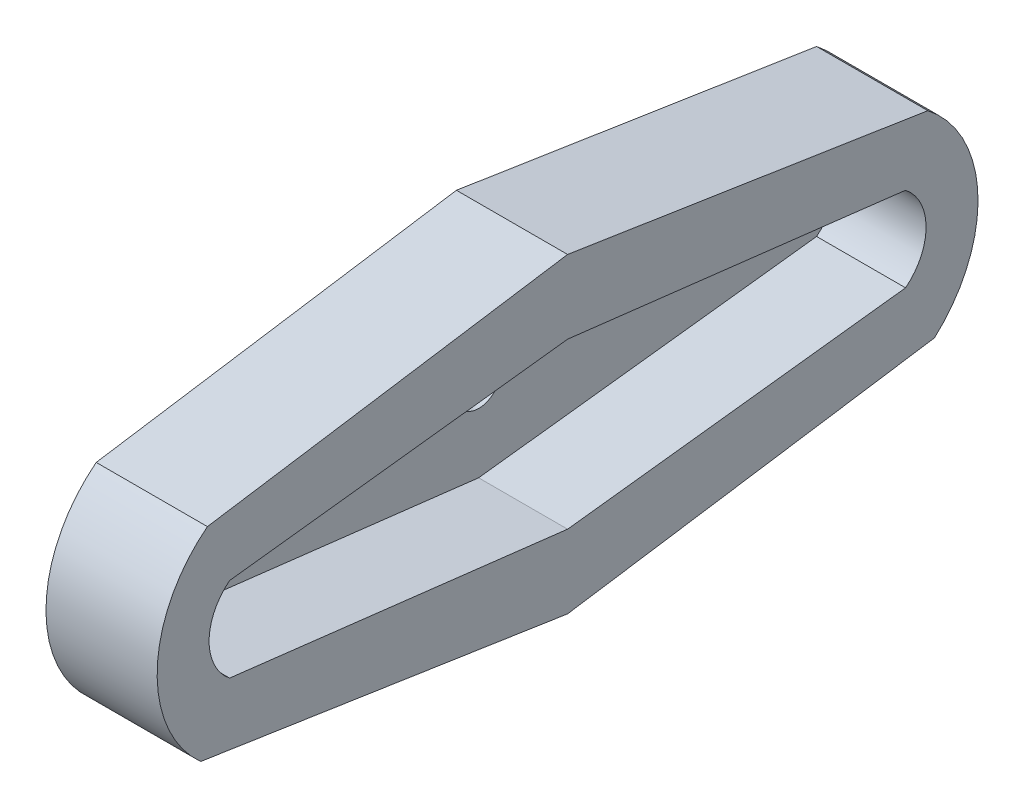
ISO-10303-21;
HEADER;
FILE_DESCRIPTION(('STEP AP214'),'2;1');
FILE_NAME('part.step','',(''),(''),'','','');
FILE_SCHEMA(('AUTOMOTIVE_DESIGN { 1 0 10303 214 1 1 1 1 }'));
ENDSEC;
DATA;
#1=APPLICATION_CONTEXT('core data for automotive mechanical design processes');
#2=APPLICATION_PROTOCOL_DEFINITION('international standard','automotive_design',2000,#1);
#3=PRODUCT_CONTEXT('',#1,'mechanical');
#4=PRODUCT('Part','Part','',(#3));
#5=PRODUCT_RELATED_PRODUCT_CATEGORY('part','',(#4));
#6=PRODUCT_DEFINITION_FORMATION('','',#4);
#7=PRODUCT_DEFINITION_CONTEXT('part definition',#1,'design');
#8=PRODUCT_DEFINITION('design','',#6,#7);
#9=PRODUCT_DEFINITION_SHAPE('','',#8);
#10=(LENGTH_UNIT() NAMED_UNIT(*) SI_UNIT(.MILLI.,.METRE.));
#11=(NAMED_UNIT(*) PLANE_ANGLE_UNIT() SI_UNIT($,.RADIAN.));
#12=(NAMED_UNIT(*) SI_UNIT($,.STERADIAN.) SOLID_ANGLE_UNIT());
#13=UNCERTAINTY_MEASURE_WITH_UNIT(LENGTH_MEASURE(1.E-05),#10,'distance_accuracy_value','');
#14=(GEOMETRIC_REPRESENTATION_CONTEXT(3) GLOBAL_UNCERTAINTY_ASSIGNED_CONTEXT((#13)) GLOBAL_UNIT_ASSIGNED_CONTEXT((#10,
#11,#12)) REPRESENTATION_CONTEXT('',''));
#15=CARTESIAN_POINT('',(0.,0.,0.));
#16=DIRECTION('',(0.,0.,1.));
#17=DIRECTION('',(1.,0.,0.));
#18=AXIS2_PLACEMENT_3D('',#15,#16,#17);
#19=CARTESIAN_POINT('',(4.,-0.125126562134235,-12.5962031359729));
#20=DIRECTION('',(-1.,0.,0.));
#21=DIRECTION('',(0.,0.,1.));
#22=AXIS2_PLACEMENT_3D('',#19,#20,#21);
#23=PLANE('',#22);
#24=DIRECTION('',(0.,0.152515596279737,0.988301063892697));
#25=VECTOR('',#24,1.);
#26=CARTESIAN_POINT('',(4.,7.,0.));
#27=LINE('',#26,#25);
#28=CARTESIAN_POINT('',(4.,4.5,-16.2));
#29=VERTEX_POINT('',#28);
#30=CARTESIAN_POINT('',(4.,7.,0.));
#31=VERTEX_POINT('',#30);
#32=EDGE_CURVE('E232',#29,#31,#27,.T.);
#33=ORIENTED_EDGE('',*,*,#32,.T.);
#34=DIRECTION('',(0.,-0.152515596279737,0.988301063892697));
#35=VECTOR('',#34,1.);
#36=CARTESIAN_POINT('',(4.,7.,0.));
#37=LINE('',#36,#35);
#38=CARTESIAN_POINT('',(4.,4.5,16.2));
#39=VERTEX_POINT('',#38);
#40=EDGE_CURVE('E134',#31,#39,#37,.T.);
#41=ORIENTED_EDGE('',*,*,#40,.T.);
#42=CARTESIAN_POINT('',(4.,-0.125126562134238,12.5962031359729));
#43=DIRECTION('',(1.,0.,0.));
#44=DIRECTION('',(0.,0.,-1.));
#45=AXIS2_PLACEMENT_3D('',#42,#43,#44);
#46=CIRCLE('',#45,5.8633733936132);
#47=CARTESIAN_POINT('',(4.,-4.5,16.5));
#48=VERTEX_POINT('',#47);
#49=EDGE_CURVE('E237',#39,#48,#46,.T.);
#50=ORIENTED_EDGE('',*,*,#49,.T.);
#51=DIRECTION('',(0.,-0.149805379427995,-0.988715504224767));
#52=VECTOR('',#51,1.);
#53=CARTESIAN_POINT('',(4.,-4.5,16.5));
#54=LINE('',#53,#52);
#55=CARTESIAN_POINT('',(4.,-7.,0.));
#56=VERTEX_POINT('',#55);
#57=EDGE_CURVE('E240',#48,#56,#54,.T.);
#58=ORIENTED_EDGE('',*,*,#57,.T.);
#59=DIRECTION('',(0.,0.149805379427995,-0.988715504224767));
#60=VECTOR('',#59,1.);
#61=CARTESIAN_POINT('',(4.,-4.5,-16.5));
#62=LINE('',#61,#60);
#63=CARTESIAN_POINT('',(4.,-4.5,-16.5));
#64=VERTEX_POINT('',#63);
#65=EDGE_CURVE('E243',#56,#64,#62,.T.);
#66=ORIENTED_EDGE('',*,*,#65,.T.);
#67=CARTESIAN_POINT('',(4.,-0.125126562134235,-12.5962031359729));
#68=DIRECTION('',(1.,0.,0.));
#69=DIRECTION('',(0.,0.,1.));
#70=AXIS2_PLACEMENT_3D('',#67,#68,#69);
#71=CIRCLE('',#70,5.8633733936132);
#72=EDGE_CURVE('E246',#64,#29,#71,.T.);
#73=ORIENTED_EDGE('',*,*,#72,.T.);
#74=EDGE_LOOP('',(#33,#41,#50,#58,#66,#73));
#75=FACE_BOUND('',#74,.T.);
#76=DIRECTION('',(0.,0.117599343536163,0.993061123194269));
#77=VECTOR('',#76,1.);
#78=CARTESIAN_POINT('',(4.,3.7,0.));
#79=LINE('',#78,#77);
#80=CARTESIAN_POINT('',(4.,1.9,-15.2));
#81=VERTEX_POINT('',#80);
#82=CARTESIAN_POINT('',(4.,3.7,0.));
#83=VERTEX_POINT('',#82);
#84=EDGE_CURVE('E175',#81,#83,#79,.T.);
#85=ORIENTED_EDGE('',*,*,#84,.F.);
#86=CARTESIAN_POINT('',(4.,0.,-13.7066815476932));
#87=DIRECTION('',(1.,0.,0.));
#88=DIRECTION('',(0.,0.,1.));
#89=AXIS2_PLACEMENT_3D('',#86,#87,#88);
#90=CIRCLE('',#89,2.41660919471891);
#91=CARTESIAN_POINT('',(4.,-1.9,-15.2));
#92=VERTEX_POINT('',#91);
#93=EDGE_CURVE('E191',#92,#81,#90,.T.);
#94=ORIENTED_EDGE('',*,*,#93,.F.);
#95=DIRECTION('',(0.,0.117599343536164,-0.993061123194269));
#96=VECTOR('',#95,1.);
#97=CARTESIAN_POINT('',(4.,-1.9,-15.2));
#98=LINE('',#97,#96);
#99=CARTESIAN_POINT('',(4.,-3.7,0.));
#100=VERTEX_POINT('',#99);
#101=EDGE_CURVE('E188',#100,#92,#98,.T.);
#102=ORIENTED_EDGE('',*,*,#101,.F.);
#103=DIRECTION('',(0.,-0.117599343536163,-0.993061123194269));
#104=VECTOR('',#103,1.);
#105=CARTESIAN_POINT('',(4.,-1.9,15.2));
#106=LINE('',#105,#104);
#107=CARTESIAN_POINT('',(4.,-1.9,15.2));
#108=VERTEX_POINT('',#107);
#109=EDGE_CURVE('E185',#108,#100,#106,.T.);
#110=ORIENTED_EDGE('',*,*,#109,.F.);
#111=CARTESIAN_POINT('',(4.,0.,13.7066815476932));
#112=DIRECTION('',(1.,0.,0.));
#113=DIRECTION('',(0.,0.,-1.));
#114=AXIS2_PLACEMENT_3D('',#111,#112,#113);
#115=CIRCLE('',#114,2.41660919471891);
#116=CARTESIAN_POINT('',(4.,1.9,15.2));
#117=VERTEX_POINT('',#116);
#118=EDGE_CURVE('E182',#117,#108,#115,.T.);
#119=ORIENTED_EDGE('',*,*,#118,.F.);
#120=DIRECTION('',(0.,-0.117599343536163,0.993061123194269));
#121=VECTOR('',#120,1.);
#122=CARTESIAN_POINT('',(4.,3.7,0.));
#123=LINE('',#122,#121);
#124=EDGE_CURVE('E178',#83,#117,#123,.T.);
#125=ORIENTED_EDGE('',*,*,#124,.F.);
#126=EDGE_LOOP('',(#85,#94,#102,#110,#119,#125));
#127=FACE_BOUND('',#126,.T.);
#128=ADVANCED_FACE('F39',(#75,#127),#23,.F.);
#129=CARTESIAN_POINT('',(4.,7.,0.));
#130=DIRECTION('',(0.,-0.988301063892697,0.152515596279737));
#131=DIRECTION('',(0.,-0.152515596279737,-0.988301063892697));
#132=AXIS2_PLACEMENT_3D('',#129,#130,#131);
#133=PLANE('',#132);
#134=DIRECTION('',(-1.,0.,0.));
#135=VECTOR('',#134,1.);
#136=CARTESIAN_POINT('',(4.,4.5,-16.2));
#137=LINE('',#136,#135);
#138=CARTESIAN_POINT('',(-1.,4.5,-16.2));
#139=VERTEX_POINT('',#138);
#140=EDGE_CURVE('E152',#29,#139,#137,.T.);
#141=ORIENTED_EDGE('',*,*,#140,.T.);
#142=DIRECTION('',(0.,0.152515596279737,0.988301063892697));
#143=VECTOR('',#142,1.);
#144=CARTESIAN_POINT('',(-1.,7.,0.));
#145=LINE('',#144,#143);
#146=CARTESIAN_POINT('',(-1.,7.,0.));
#147=VERTEX_POINT('',#146);
#148=EDGE_CURVE('E144',#139,#147,#145,.T.);
#149=ORIENTED_EDGE('',*,*,#148,.T.);
#150=DIRECTION('',(-1.,0.,0.));
#151=VECTOR('',#150,1.);
#152=CARTESIAN_POINT('',(4.,7.,0.));
#153=LINE('',#152,#151);
#154=EDGE_CURVE('E11',#31,#147,#153,.T.);
#155=ORIENTED_EDGE('',*,*,#154,.F.);
#156=ORIENTED_EDGE('',*,*,#32,.F.);
#157=EDGE_LOOP('',(#141,#149,#155,#156));
#158=FACE_BOUND('',#157,.T.);
#159=ADVANCED_FACE('F41',(#158),#133,.F.);
#160=CARTESIAN_POINT('',(4.,7.,0.));
#161=DIRECTION('',(0.,-0.988301063892697,-0.152515596279737));
#162=DIRECTION('',(0.,0.152515596279737,-0.988301063892697));
#163=AXIS2_PLACEMENT_3D('',#160,#161,#162);
#164=PLANE('',#163);
#165=ORIENTED_EDGE('',*,*,#154,.T.);
#166=DIRECTION('',(0.,-0.152515596279737,0.988301063892697));
#167=VECTOR('',#166,1.);
#168=CARTESIAN_POINT('',(-1.,7.,0.));
#169=LINE('',#168,#167);
#170=CARTESIAN_POINT('',(-1.,4.5,16.2));
#171=VERTEX_POINT('',#170);
#172=EDGE_CURVE('E133',#147,#171,#169,.T.);
#173=ORIENTED_EDGE('',*,*,#172,.T.);
#174=DIRECTION('',(-1.,0.,0.));
#175=VECTOR('',#174,1.);
#176=CARTESIAN_POINT('',(4.,4.5,16.2));
#177=LINE('',#176,#175);
#178=EDGE_CURVE('E48',#39,#171,#177,.T.);
#179=ORIENTED_EDGE('',*,*,#178,.F.);
#180=ORIENTED_EDGE('',*,*,#40,.F.);
#181=EDGE_LOOP('',(#165,#173,#179,#180));
#182=FACE_BOUND('',#181,.T.);
#183=ADVANCED_FACE('F131',(#182),#164,.F.);
#184=CARTESIAN_POINT('',(4.,-0.125126562134238,12.5962031359729));
#185=DIRECTION('',(-1.,0.,0.));
#186=DIRECTION('',(0.,0.,1.));
#187=AXIS2_PLACEMENT_3D('',#184,#185,#186);
#188=CYLINDRICAL_SURFACE('',#187,5.8633733936132);
#189=ORIENTED_EDGE('',*,*,#178,.T.);
#190=CARTESIAN_POINT('',(-1.,-0.125126562134238,12.5962031359729));
#191=DIRECTION('',(1.,0.,0.));
#192=DIRECTION('',(0.,0.,-1.));
#193=AXIS2_PLACEMENT_3D('',#190,#191,#192);
#194=CIRCLE('',#193,5.8633733936132);
#195=CARTESIAN_POINT('',(-1.,-4.5,16.5));
#196=VERTEX_POINT('',#195);
#197=EDGE_CURVE('E148',#171,#196,#194,.T.);
#198=ORIENTED_EDGE('',*,*,#197,.T.);
#199=DIRECTION('',(-1.,0.,0.));
#200=VECTOR('',#199,1.);
#201=CARTESIAN_POINT('',(4.,-4.5,16.5));
#202=LINE('',#201,#200);
#203=EDGE_CURVE('E257',#48,#196,#202,.T.);
#204=ORIENTED_EDGE('',*,*,#203,.F.);
#205=ORIENTED_EDGE('',*,*,#49,.F.);
#206=EDGE_LOOP('',(#189,#198,#204,#205));
#207=FACE_BOUND('',#206,.T.);
#208=ADVANCED_FACE('F262',(#207),#188,.T.);
#209=CARTESIAN_POINT('',(4.,-4.5,16.5));
#210=DIRECTION('',(0.,0.988715504224767,-0.149805379427995));
#211=DIRECTION('',(0.,0.149805379427995,0.988715504224767));
#212=AXIS2_PLACEMENT_3D('',#209,#210,#211);
#213=PLANE('',#212);
#214=ORIENTED_EDGE('',*,*,#203,.T.);
#215=DIRECTION('',(0.,-0.149805379427995,-0.988715504224767));
#216=VECTOR('',#215,1.);
#217=CARTESIAN_POINT('',(-1.,-4.5,16.5));
#218=LINE('',#217,#216);
#219=CARTESIAN_POINT('',(-1.,-7.,0.));
#220=VERTEX_POINT('',#219);
#221=EDGE_CURVE('E164',#196,#220,#218,.T.);
#222=ORIENTED_EDGE('',*,*,#221,.T.);
#223=DIRECTION('',(-1.,0.,0.));
#224=VECTOR('',#223,1.);
#225=CARTESIAN_POINT('',(4.,-7.,0.));
#226=LINE('',#225,#224);
#227=EDGE_CURVE('E254',#56,#220,#226,.T.);
#228=ORIENTED_EDGE('',*,*,#227,.F.);
#229=ORIENTED_EDGE('',*,*,#57,.F.);
#230=EDGE_LOOP('',(#214,#222,#228,#229));
#231=FACE_BOUND('',#230,.T.);
#232=ADVANCED_FACE('F276',(#231),#213,.F.);
#233=CARTESIAN_POINT('',(4.,-4.5,-16.5));
#234=DIRECTION('',(0.,0.988715504224767,0.149805379427995));
#235=DIRECTION('',(0.,-0.149805379427995,0.988715504224767));
#236=AXIS2_PLACEMENT_3D('',#233,#234,#235);
#237=PLANE('',#236);
#238=ORIENTED_EDGE('',*,*,#227,.T.);
#239=DIRECTION('',(0.,0.149805379427995,-0.988715504224767));
#240=VECTOR('',#239,1.);
#241=CARTESIAN_POINT('',(-1.,-4.5,-16.5));
#242=LINE('',#241,#240);
#243=CARTESIAN_POINT('',(-1.,-4.5,-16.5));
#244=VERTEX_POINT('',#243);
#245=EDGE_CURVE('E168',#220,#244,#242,.T.);
#246=ORIENTED_EDGE('',*,*,#245,.T.);
#247=DIRECTION('',(-1.,0.,0.));
#248=VECTOR('',#247,1.);
#249=CARTESIAN_POINT('',(4.,-4.5,-16.5));
#250=LINE('',#249,#248);
#251=EDGE_CURVE('E251',#64,#244,#250,.T.);
#252=ORIENTED_EDGE('',*,*,#251,.F.);
#253=ORIENTED_EDGE('',*,*,#65,.F.);
#254=EDGE_LOOP('',(#238,#246,#252,#253));
#255=FACE_BOUND('',#254,.T.);
#256=ADVANCED_FACE('F277',(#255),#237,.F.);
#257=CARTESIAN_POINT('',(4.,-0.125126562134235,-12.5962031359729));
#258=DIRECTION('',(-1.,0.,0.));
#259=DIRECTION('',(0.,0.,1.));
#260=AXIS2_PLACEMENT_3D('',#257,#258,#259);
#261=CYLINDRICAL_SURFACE('',#260,5.8633733936132);
#262=ORIENTED_EDGE('',*,*,#251,.T.);
#263=CARTESIAN_POINT('',(-1.,-0.125126562134238,-12.5962031359729));
#264=DIRECTION('',(1.,0.,0.));
#265=DIRECTION('',(0.,0.,1.));
#266=AXIS2_PLACEMENT_3D('',#263,#264,#265);
#267=CIRCLE('',#266,5.8633733936132);
#268=EDGE_CURVE('E172',#244,#139,#267,.T.);
#269=ORIENTED_EDGE('',*,*,#268,.T.);
#270=ORIENTED_EDGE('',*,*,#140,.F.);
#271=ORIENTED_EDGE('',*,*,#72,.F.);
#272=EDGE_LOOP('',(#262,#269,#270,#271));
#273=FACE_BOUND('',#272,.T.);
#274=ADVANCED_FACE('F272',(#273),#261,.T.);
#275=CARTESIAN_POINT('',(4.,3.7,0.));
#276=DIRECTION('',(0.,-0.993061123194269,0.117599343536163));
#277=DIRECTION('',(0.,-0.117599343536163,-0.993061123194269));
#278=AXIS2_PLACEMENT_3D('',#275,#276,#277);
#279=PLANE('',#278);
#280=DIRECTION('',(0.,0.117599343536163,0.993061123194269));
#281=VECTOR('',#280,1.);
#282=CARTESIAN_POINT('',(0.,3.7,0.));
#283=LINE('',#282,#281);
#284=CARTESIAN_POINT('',(0.,1.9,-15.2));
#285=VERTEX_POINT('',#284);
#286=CARTESIAN_POINT('',(0.,3.7,0.));
#287=VERTEX_POINT('',#286);
#288=EDGE_CURVE('E63',#285,#287,#283,.T.);
#289=ORIENTED_EDGE('',*,*,#288,.F.);
#290=DIRECTION('',(-1.,0.,0.));
#291=VECTOR('',#290,1.);
#292=CARTESIAN_POINT('',(4.,1.9,-15.2));
#293=LINE('',#292,#291);
#294=EDGE_CURVE('E194',#81,#285,#293,.T.);
#295=ORIENTED_EDGE('',*,*,#294,.F.);
#296=ORIENTED_EDGE('',*,*,#84,.T.);
#297=DIRECTION('',(-1.,0.,0.));
#298=VECTOR('',#297,1.);
#299=CARTESIAN_POINT('',(4.,3.7,0.));
#300=LINE('',#299,#298);
#301=EDGE_CURVE('E229',#83,#287,#300,.T.);
#302=ORIENTED_EDGE('',*,*,#301,.T.);
#303=EDGE_LOOP('',(#289,#295,#296,#302));
#304=FACE_BOUND('',#303,.T.);
#305=ADVANCED_FACE('F284',(#304),#279,.T.);
#306=CARTESIAN_POINT('',(4.,3.7,0.));
#307=DIRECTION('',(0.,-0.993061123194269,-0.117599343536163));
#308=DIRECTION('',(0.,0.117599343536163,-0.993061123194269));
#309=AXIS2_PLACEMENT_3D('',#306,#307,#308);
#310=PLANE('',#309);
#311=DIRECTION('',(0.,-0.117599343536163,0.993061123194269));
#312=VECTOR('',#311,1.);
#313=CARTESIAN_POINT('',(0.,3.7,0.));
#314=LINE('',#313,#312);
#315=CARTESIAN_POINT('',(0.,1.9,15.2));
#316=VERTEX_POINT('',#315);
#317=EDGE_CURVE('E197',#287,#316,#314,.T.);
#318=ORIENTED_EDGE('',*,*,#317,.F.);
#319=ORIENTED_EDGE('',*,*,#301,.F.);
#320=ORIENTED_EDGE('',*,*,#124,.T.);
#321=DIRECTION('',(-1.,0.,0.));
#322=VECTOR('',#321,1.);
#323=CARTESIAN_POINT('',(4.,1.9,15.2));
#324=LINE('',#323,#322);
#325=EDGE_CURVE('E226',#117,#316,#324,.T.);
#326=ORIENTED_EDGE('',*,*,#325,.T.);
#327=EDGE_LOOP('',(#318,#319,#320,#326));
#328=FACE_BOUND('',#327,.T.);
#329=ADVANCED_FACE('F295',(#328),#310,.T.);
#330=CARTESIAN_POINT('',(4.,0.,13.7066815476932));
#331=DIRECTION('',(-1.,0.,0.));
#332=DIRECTION('',(0.,0.,1.));
#333=AXIS2_PLACEMENT_3D('',#330,#331,#332);
#334=CYLINDRICAL_SURFACE('',#333,2.41660919471891);
#335=CARTESIAN_POINT('',(0.,0.,13.7066815476932));
#336=DIRECTION('',(1.,0.,0.));
#337=DIRECTION('',(0.,0.,-1.));
#338=AXIS2_PLACEMENT_3D('',#335,#336,#337);
#339=CIRCLE('',#338,2.41660919471891);
#340=CARTESIAN_POINT('',(0.,-1.9,15.2));
#341=VERTEX_POINT('',#340);
#342=EDGE_CURVE('E201',#316,#341,#339,.T.);
#343=ORIENTED_EDGE('',*,*,#342,.F.);
#344=ORIENTED_EDGE('',*,*,#325,.F.);
#345=ORIENTED_EDGE('',*,*,#118,.T.);
#346=DIRECTION('',(-1.,0.,0.));
#347=VECTOR('',#346,1.);
#348=CARTESIAN_POINT('',(4.,-1.9,15.2));
#349=LINE('',#348,#347);
#350=EDGE_CURVE('E223',#108,#341,#349,.T.);
#351=ORIENTED_EDGE('',*,*,#350,.T.);
#352=EDGE_LOOP('',(#343,#344,#345,#351));
#353=FACE_BOUND('',#352,.T.);
#354=ADVANCED_FACE('F298',(#353),#334,.F.);
#355=CARTESIAN_POINT('',(4.,-1.9,15.2));
#356=DIRECTION('',(0.,0.993061123194269,-0.117599343536163));
#357=DIRECTION('',(0.,0.117599343536163,0.993061123194269));
#358=AXIS2_PLACEMENT_3D('',#355,#356,#357);
#359=PLANE('',#358);
#360=DIRECTION('',(0.,-0.117599343536163,-0.993061123194269));
#361=VECTOR('',#360,1.);
#362=CARTESIAN_POINT('',(0.,-1.9,15.2));
#363=LINE('',#362,#361);
#364=CARTESIAN_POINT('',(0.,-3.7,0.));
#365=VERTEX_POINT('',#364);
#366=EDGE_CURVE('E205',#341,#365,#363,.T.);
#367=ORIENTED_EDGE('',*,*,#366,.F.);
#368=ORIENTED_EDGE('',*,*,#350,.F.);
#369=ORIENTED_EDGE('',*,*,#109,.T.);
#370=DIRECTION('',(-1.,0.,0.));
#371=VECTOR('',#370,1.);
#372=CARTESIAN_POINT('',(4.,-3.7,0.));
#373=LINE('',#372,#371);
#374=EDGE_CURVE('E220',#100,#365,#373,.T.);
#375=ORIENTED_EDGE('',*,*,#374,.T.);
#376=EDGE_LOOP('',(#367,#368,#369,#375));
#377=FACE_BOUND('',#376,.T.);
#378=ADVANCED_FACE('F302',(#377),#359,.T.);
#379=CARTESIAN_POINT('',(4.,-1.9,-15.2));
#380=DIRECTION('',(0.,0.993061123194269,0.117599343536164));
#381=DIRECTION('',(0.,-0.117599343536164,0.993061123194269));
#382=AXIS2_PLACEMENT_3D('',#379,#380,#381);
#383=PLANE('',#382);
#384=DIRECTION('',(0.,0.117599343536164,-0.993061123194269));
#385=VECTOR('',#384,1.);
#386=CARTESIAN_POINT('',(0.,-1.9,-15.2));
#387=LINE('',#386,#385);
#388=CARTESIAN_POINT('',(0.,-1.9,-15.2));
#389=VERTEX_POINT('',#388);
#390=EDGE_CURVE('E209',#365,#389,#387,.T.);
#391=ORIENTED_EDGE('',*,*,#390,.F.);
#392=ORIENTED_EDGE('',*,*,#374,.F.);
#393=ORIENTED_EDGE('',*,*,#101,.T.);
#394=DIRECTION('',(-1.,0.,0.));
#395=VECTOR('',#394,1.);
#396=CARTESIAN_POINT('',(4.,-1.9,-15.2));
#397=LINE('',#396,#395);
#398=EDGE_CURVE('E55',#92,#389,#397,.T.);
#399=ORIENTED_EDGE('',*,*,#398,.T.);
#400=EDGE_LOOP('',(#391,#392,#393,#399));
#401=FACE_BOUND('',#400,.T.);
#402=ADVANCED_FACE('F306',(#401),#383,.T.);
#403=CARTESIAN_POINT('',(4.,0.,-13.7066815476932));
#404=DIRECTION('',(-1.,0.,0.));
#405=DIRECTION('',(0.,0.,1.));
#406=AXIS2_PLACEMENT_3D('',#403,#404,#405);
#407=CYLINDRICAL_SURFACE('',#406,2.41660919471891);
#408=CARTESIAN_POINT('',(0.,0.,-13.7066815476932));
#409=DIRECTION('',(1.,0.,0.));
#410=DIRECTION('',(0.,0.,1.));
#411=AXIS2_PLACEMENT_3D('',#408,#409,#410);
#412=CIRCLE('',#411,2.41660919471891);
#413=EDGE_CURVE('E179',#389,#285,#412,.T.);
#414=ORIENTED_EDGE('',*,*,#413,.F.);
#415=ORIENTED_EDGE('',*,*,#398,.F.);
#416=ORIENTED_EDGE('',*,*,#93,.T.);
#417=ORIENTED_EDGE('',*,*,#294,.T.);
#418=EDGE_LOOP('',(#414,#415,#416,#417));
#419=FACE_BOUND('',#418,.T.);
#420=ADVANCED_FACE('F310',(#419),#407,.F.);
#421=CARTESIAN_POINT('',(0.,-0.125126562134238,-12.5962031359729));
#422=DIRECTION('',(-1.,0.,0.));
#423=DIRECTION('',(0.,0.,1.));
#424=AXIS2_PLACEMENT_3D('',#421,#422,#423);
#425=PLANE('',#424);
#426=CARTESIAN_POINT('',(0.,0.,0.));
#427=DIRECTION('',(1.,0.,0.));
#428=DIRECTION('',(0.,0.,-1.));
#429=AXIS2_PLACEMENT_3D('',#426,#427,#428);
#430=CIRCLE('',#429,1.);
#431=CARTESIAN_POINT('',(0.,0.,-1.));
#432=VERTEX_POINT('',#431);
#433=EDGE_CURVE('E158',#432,#432,#430,.T.);
#434=ORIENTED_EDGE('',*,*,#433,.F.);
#435=EDGE_LOOP('',(#434));
#436=FACE_BOUND('',#435,.T.);
#437=ORIENTED_EDGE('',*,*,#390,.T.);
#438=ORIENTED_EDGE('',*,*,#413,.T.);
#439=ORIENTED_EDGE('',*,*,#288,.T.);
#440=ORIENTED_EDGE('',*,*,#317,.T.);
#441=ORIENTED_EDGE('',*,*,#342,.T.);
#442=ORIENTED_EDGE('',*,*,#366,.T.);
#443=EDGE_LOOP('',(#437,#438,#439,#440,#441,#442));
#444=FACE_BOUND('',#443,.T.);
#445=ADVANCED_FACE('F314',(#436,#444),#425,.F.);
#446=CARTESIAN_POINT('',(-1.,-0.125126562134238,-12.5962031359729));
#447=DIRECTION('',(-1.,0.,0.));
#448=DIRECTION('',(0.,0.,1.));
#449=AXIS2_PLACEMENT_3D('',#446,#447,#448);
#450=PLANE('',#449);
#451=CARTESIAN_POINT('',(-1.,0.,0.));
#452=DIRECTION('',(1.,0.,0.));
#453=DIRECTION('',(0.,0.,-1.));
#454=AXIS2_PLACEMENT_3D('',#451,#452,#453);
#455=CIRCLE('',#454,1.);
#456=CARTESIAN_POINT('',(-1.,0.,-1.));
#457=VERTEX_POINT('',#456);
#458=EDGE_CURVE('E154',#457,#457,#455,.T.);
#459=ORIENTED_EDGE('',*,*,#458,.T.);
#460=EDGE_LOOP('',(#459));
#461=FACE_BOUND('',#460,.T.);
#462=ORIENTED_EDGE('',*,*,#148,.F.);
#463=ORIENTED_EDGE('',*,*,#268,.F.);
#464=ORIENTED_EDGE('',*,*,#245,.F.);
#465=ORIENTED_EDGE('',*,*,#221,.F.);
#466=ORIENTED_EDGE('',*,*,#197,.F.);
#467=ORIENTED_EDGE('',*,*,#172,.F.);
#468=EDGE_LOOP('',(#462,#463,#464,#465,#466,#467));
#469=FACE_BOUND('',#468,.T.);
#470=ADVANCED_FACE('F142',(#461,#469),#450,.T.);
#471=CARTESIAN_POINT('',(-1.,0.,0.));
#472=DIRECTION('',(1.,0.,0.));
#473=DIRECTION('',(0.,0.,-1.));
#474=AXIS2_PLACEMENT_3D('',#471,#472,#473);
#475=CYLINDRICAL_SURFACE('',#474,1.);
#476=ORIENTED_EDGE('',*,*,#458,.F.);
#477=EDGE_LOOP('',(#476));
#478=FACE_BOUND('',#477,.T.);
#479=ORIENTED_EDGE('',*,*,#433,.T.);
#480=EDGE_LOOP('',(#479));
#481=FACE_BOUND('',#480,.T.);
#482=ADVANCED_FACE('F320',(#478,#481),#475,.F.);
#483=CLOSED_SHELL('',(#128,#159,#183,#208,#232,#256,#274,#305,#329,#354,#378,#402,#420,#445,
#470,#482));
#484=MANIFOLD_SOLID_BREP('B2',#483);
#485=ADVANCED_BREP_SHAPE_REPRESENTATION('',(#18,#484),#14);
#486=SHAPE_DEFINITION_REPRESENTATION(#9,#485);
ENDSEC;
END-ISO-10303-21;
